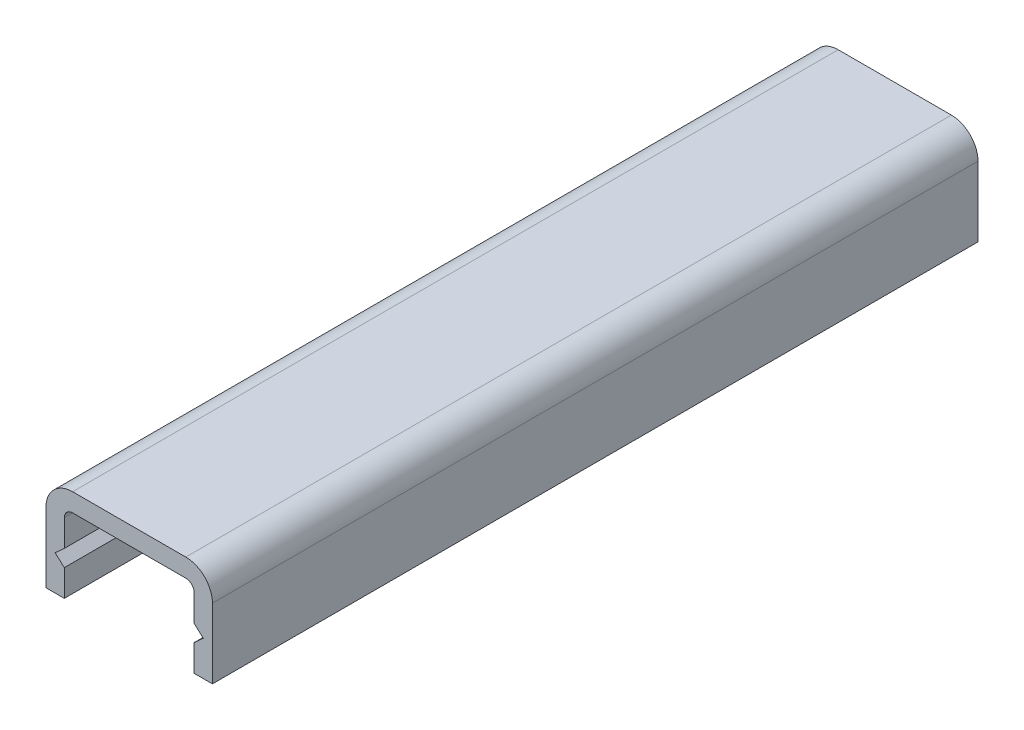
ISO-10303-21;
HEADER;
FILE_DESCRIPTION(('STEP AP214'),'2;1');
FILE_NAME('part.step','',(''),(''),'','','');
FILE_SCHEMA(('AUTOMOTIVE_DESIGN { 1 0 10303 214 1 1 1 1 }'));
ENDSEC;
DATA;
#1=APPLICATION_CONTEXT('core data for automotive mechanical design processes');
#2=APPLICATION_PROTOCOL_DEFINITION('international standard','automotive_design',2000,#1);
#3=PRODUCT_CONTEXT('',#1,'mechanical');
#4=PRODUCT('Part','Part','',(#3));
#5=PRODUCT_RELATED_PRODUCT_CATEGORY('part','',(#4));
#6=PRODUCT_DEFINITION_FORMATION('','',#4);
#7=PRODUCT_DEFINITION_CONTEXT('part definition',#1,'design');
#8=PRODUCT_DEFINITION('design','',#6,#7);
#9=PRODUCT_DEFINITION_SHAPE('','',#8);
#10=(LENGTH_UNIT() NAMED_UNIT(*) SI_UNIT(.MILLI.,.METRE.));
#11=(NAMED_UNIT(*) PLANE_ANGLE_UNIT() SI_UNIT($,.RADIAN.));
#12=(NAMED_UNIT(*) SI_UNIT($,.STERADIAN.) SOLID_ANGLE_UNIT());
#13=UNCERTAINTY_MEASURE_WITH_UNIT(LENGTH_MEASURE(1.E-05),#10,'distance_accuracy_value','');
#14=(GEOMETRIC_REPRESENTATION_CONTEXT(3) GLOBAL_UNCERTAINTY_ASSIGNED_CONTEXT((#13)) GLOBAL_UNIT_ASSIGNED_CONTEXT((#10,
#11,#12)) REPRESENTATION_CONTEXT('',''));
#15=CARTESIAN_POINT('',(0.,0.,0.));
#16=DIRECTION('',(0.,0.,1.));
#17=DIRECTION('',(1.,0.,0.));
#18=AXIS2_PLACEMENT_3D('',#15,#16,#17);
#19=CARTESIAN_POINT('',(0.,0.,46.));
#20=DIRECTION('',(0.,1.,0.));
#21=DIRECTION('',(0.,0.,1.));
#22=AXIS2_PLACEMENT_3D('',#19,#20,#21);
#23=PLANE('',#22);
#24=DIRECTION('',(1.,0.,0.));
#25=VECTOR('',#24,1.);
#26=CARTESIAN_POINT('',(0.,0.,0.));
#27=LINE('',#26,#25);
#28=CARTESIAN_POINT('',(0.,0.,0.));
#29=VERTEX_POINT('',#28);
#30=CARTESIAN_POINT('',(1.1,0.,0.));
#31=VERTEX_POINT('',#30);
#32=EDGE_CURVE('E186',#29,#31,#27,.T.);
#33=ORIENTED_EDGE('',*,*,#32,.T.);
#34=DIRECTION('',(0.,0.,-1.));
#35=VECTOR('',#34,1.);
#36=CARTESIAN_POINT('',(1.1,0.,46.));
#37=LINE('',#36,#35);
#38=CARTESIAN_POINT('',(1.1,0.,46.));
#39=VERTEX_POINT('',#38);
#40=EDGE_CURVE('E11',#39,#31,#37,.T.);
#41=ORIENTED_EDGE('',*,*,#40,.F.);
#42=DIRECTION('',(1.,0.,0.));
#43=VECTOR('',#42,1.);
#44=CARTESIAN_POINT('',(0.,0.,46.));
#45=LINE('',#44,#43);
#46=CARTESIAN_POINT('',(0.,0.,46.));
#47=VERTEX_POINT('',#46);
#48=EDGE_CURVE('E220',#47,#39,#45,.T.);
#49=ORIENTED_EDGE('',*,*,#48,.F.);
#50=DIRECTION('',(0.,0.,-1.));
#51=VECTOR('',#50,1.);
#52=CARTESIAN_POINT('',(0.,0.,46.));
#53=LINE('',#52,#51);
#54=EDGE_CURVE('E182',#47,#29,#53,.T.);
#55=ORIENTED_EDGE('',*,*,#54,.T.);
#56=EDGE_LOOP('',(#33,#41,#49,#55));
#57=FACE_BOUND('',#56,.T.);
#58=ADVANCED_FACE('F30',(#57),#23,.F.);
#59=CARTESIAN_POINT('',(1.1,1.6,46.));
#60=DIRECTION('',(-1.,0.,0.));
#61=DIRECTION('',(0.,0.,1.));
#62=AXIS2_PLACEMENT_3D('',#59,#60,#61);
#63=PLANE('',#62);
#64=DIRECTION('',(0.,1.,0.));
#65=VECTOR('',#64,1.);
#66=CARTESIAN_POINT('',(1.1,1.6,0.));
#67=LINE('',#66,#65);
#68=CARTESIAN_POINT('',(1.1,1.6,0.));
#69=VERTEX_POINT('',#68);
#70=EDGE_CURVE('E189',#31,#69,#67,.T.);
#71=ORIENTED_EDGE('',*,*,#70,.T.);
#72=DIRECTION('',(0.,0.,-1.));
#73=VECTOR('',#72,1.);
#74=CARTESIAN_POINT('',(1.1,1.6,46.));
#75=LINE('',#74,#73);
#76=CARTESIAN_POINT('',(1.1,1.6,46.));
#77=VERTEX_POINT('',#76);
#78=EDGE_CURVE('E38',#77,#69,#75,.T.);
#79=ORIENTED_EDGE('',*,*,#78,.F.);
#80=DIRECTION('',(0.,1.,0.));
#81=VECTOR('',#80,1.);
#82=CARTESIAN_POINT('',(1.1,1.6,46.));
#83=LINE('',#82,#81);
#84=EDGE_CURVE('E119',#39,#77,#83,.T.);
#85=ORIENTED_EDGE('',*,*,#84,.F.);
#86=ORIENTED_EDGE('',*,*,#40,.T.);
#87=EDGE_LOOP('',(#71,#79,#85,#86));
#88=FACE_BOUND('',#87,.T.);
#89=ADVANCED_FACE('F328',(#88),#63,.F.);
#90=CARTESIAN_POINT('',(1.1,1.6,46.));
#91=DIRECTION('',(-0.672672793996314,-0.739940073395942,0.));
#92=DIRECTION('',(0.739940073395943,-0.672672793996314,0.));
#93=AXIS2_PLACEMENT_3D('',#90,#91,#92);
#94=PLANE('',#93);
#95=DIRECTION('',(-0.739940073395943,0.672672793996314,0.));
#96=VECTOR('',#95,1.);
#97=CARTESIAN_POINT('',(1.1,1.6,0.));
#98=LINE('',#97,#96);
#99=CARTESIAN_POINT('',(0.55,2.1,0.));
#100=VERTEX_POINT('',#99);
#101=EDGE_CURVE('E191',#69,#100,#98,.T.);
#102=ORIENTED_EDGE('',*,*,#101,.T.);
#103=DIRECTION('',(0.,0.,-1.));
#104=VECTOR('',#103,1.);
#105=CARTESIAN_POINT('',(0.55,2.1,46.));
#106=LINE('',#105,#104);
#107=CARTESIAN_POINT('',(0.55,2.1,46.));
#108=VERTEX_POINT('',#107);
#109=EDGE_CURVE('E257',#108,#100,#106,.T.);
#110=ORIENTED_EDGE('',*,*,#109,.F.);
#111=DIRECTION('',(-0.739940073395943,0.672672793996314,0.));
#112=VECTOR('',#111,1.);
#113=CARTESIAN_POINT('',(1.1,1.6,46.));
#114=LINE('',#113,#112);
#115=EDGE_CURVE('E265',#77,#108,#114,.T.);
#116=ORIENTED_EDGE('',*,*,#115,.F.);
#117=ORIENTED_EDGE('',*,*,#78,.T.);
#118=EDGE_LOOP('',(#102,#110,#116,#117));
#119=FACE_BOUND('',#118,.T.);
#120=ADVANCED_FACE('F263',(#119),#94,.F.);
#121=CARTESIAN_POINT('',(1.1,2.6,46.));
#122=DIRECTION('',(-0.672672793996311,0.739940073395945,0.));
#123=DIRECTION('',(-0.739940073395945,-0.672672793996311,0.));
#124=AXIS2_PLACEMENT_3D('',#121,#122,#123);
#125=PLANE('',#124);
#126=DIRECTION('',(0.739940073395945,0.672672793996311,0.));
#127=VECTOR('',#126,1.);
#128=CARTESIAN_POINT('',(1.1,2.6,0.));
#129=LINE('',#128,#127);
#130=CARTESIAN_POINT('',(1.1,2.6,0.));
#131=VERTEX_POINT('',#130);
#132=EDGE_CURVE('E193',#100,#131,#129,.T.);
#133=ORIENTED_EDGE('',*,*,#132,.T.);
#134=DIRECTION('',(0.,0.,-1.));
#135=VECTOR('',#134,1.);
#136=CARTESIAN_POINT('',(1.1,2.6,46.));
#137=LINE('',#136,#135);
#138=CARTESIAN_POINT('',(1.1,2.6,46.));
#139=VERTEX_POINT('',#138);
#140=EDGE_CURVE('E254',#139,#131,#137,.T.);
#141=ORIENTED_EDGE('',*,*,#140,.F.);
#142=DIRECTION('',(0.739940073395945,0.672672793996311,0.));
#143=VECTOR('',#142,1.);
#144=CARTESIAN_POINT('',(1.1,2.6,46.));
#145=LINE('',#144,#143);
#146=EDGE_CURVE('E283',#108,#139,#145,.T.);
#147=ORIENTED_EDGE('',*,*,#146,.F.);
#148=ORIENTED_EDGE('',*,*,#109,.T.);
#149=EDGE_LOOP('',(#133,#141,#147,#148));
#150=FACE_BOUND('',#149,.T.);
#151=ADVANCED_FACE('F274',(#150),#125,.F.);
#152=CARTESIAN_POINT('',(1.1,4.2,46.));
#153=DIRECTION('',(-1.,0.,0.));
#154=DIRECTION('',(0.,-1.,0.));
#155=AXIS2_PLACEMENT_3D('',#152,#153,#154);
#156=PLANE('',#155);
#157=DIRECTION('',(0.,1.,0.));
#158=VECTOR('',#157,1.);
#159=CARTESIAN_POINT('',(1.1,4.2,0.));
#160=LINE('',#159,#158);
#161=CARTESIAN_POINT('',(1.1,4.2,0.));
#162=VERTEX_POINT('',#161);
#163=EDGE_CURVE('E195',#131,#162,#160,.T.);
#164=ORIENTED_EDGE('',*,*,#163,.T.);
#165=DIRECTION('',(0.,0.,-1.));
#166=VECTOR('',#165,1.);
#167=CARTESIAN_POINT('',(1.1,4.2,46.));
#168=LINE('',#167,#166);
#169=CARTESIAN_POINT('',(1.1,4.2,46.));
#170=VERTEX_POINT('',#169);
#171=EDGE_CURVE('E251',#170,#162,#168,.T.);
#172=ORIENTED_EDGE('',*,*,#171,.F.);
#173=DIRECTION('',(0.,1.,0.));
#174=VECTOR('',#173,1.);
#175=CARTESIAN_POINT('',(1.1,4.2,46.));
#176=LINE('',#175,#174);
#177=EDGE_CURVE('E280',#139,#170,#176,.T.);
#178=ORIENTED_EDGE('',*,*,#177,.F.);
#179=ORIENTED_EDGE('',*,*,#140,.T.);
#180=EDGE_LOOP('',(#164,#172,#178,#179));
#181=FACE_BOUND('',#180,.T.);
#182=ADVANCED_FACE('F278',(#181),#156,.F.);
#183=CARTESIAN_POINT('',(1.59999999999999,4.2,46.));
#184=DIRECTION('',(0.,0.,-1.));
#185=DIRECTION('',(-1.,0.,0.));
#186=AXIS2_PLACEMENT_3D('',#183,#184,#185);
#187=CYLINDRICAL_SURFACE('',#186,0.499999999999992);
#188=CARTESIAN_POINT('',(1.59999999999999,4.2,0.));
#189=DIRECTION('',(0.,0.,-1.));
#190=DIRECTION('',(1.,0.,0.));
#191=AXIS2_PLACEMENT_3D('',#188,#189,#190);
#192=CIRCLE('',#191,0.499999999999992);
#193=CARTESIAN_POINT('',(1.59999999999999,4.69999999999999,0.));
#194=VERTEX_POINT('',#193);
#195=EDGE_CURVE('E197',#162,#194,#192,.T.);
#196=ORIENTED_EDGE('',*,*,#195,.T.);
#197=DIRECTION('',(0.,0.,-1.));
#198=VECTOR('',#197,1.);
#199=CARTESIAN_POINT('',(1.59999999999999,4.69999999999999,46.));
#200=LINE('',#199,#198);
#201=CARTESIAN_POINT('',(1.59999999999999,4.69999999999999,46.));
#202=VERTEX_POINT('',#201);
#203=EDGE_CURVE('E248',#202,#194,#200,.T.);
#204=ORIENTED_EDGE('',*,*,#203,.F.);
#205=CARTESIAN_POINT('',(1.59999999999999,4.2,46.));
#206=DIRECTION('',(0.,0.,-1.));
#207=DIRECTION('',(1.,0.,0.));
#208=AXIS2_PLACEMENT_3D('',#205,#206,#207);
#209=CIRCLE('',#208,0.499999999999992);
#210=EDGE_CURVE('E282',#170,#202,#209,.T.);
#211=ORIENTED_EDGE('',*,*,#210,.F.);
#212=ORIENTED_EDGE('',*,*,#171,.T.);
#213=EDGE_LOOP('',(#196,#204,#211,#212));
#214=FACE_BOUND('',#213,.T.);
#215=ADVANCED_FACE('F341',(#214),#187,.F.);
#216=CARTESIAN_POINT('',(1.59999999999999,4.69999999999999,46.));
#217=DIRECTION('',(0.,1.,0.));
#218=DIRECTION('',(0.,0.,1.));
#219=AXIS2_PLACEMENT_3D('',#216,#217,#218);
#220=PLANE('',#219);
#221=DIRECTION('',(1.,0.,0.));
#222=VECTOR('',#221,1.);
#223=CARTESIAN_POINT('',(1.59999999999999,4.69999999999999,0.));
#224=LINE('',#223,#222);
#225=CARTESIAN_POINT('',(8.39999999999998,4.69999999999999,0.));
#226=VERTEX_POINT('',#225);
#227=EDGE_CURVE('E199',#194,#226,#224,.T.);
#228=ORIENTED_EDGE('',*,*,#227,.T.);
#229=DIRECTION('',(0.,0.,-1.));
#230=VECTOR('',#229,1.);
#231=CARTESIAN_POINT('',(8.39999999999998,4.69999999999999,46.));
#232=LINE('',#231,#230);
#233=CARTESIAN_POINT('',(8.39999999999998,4.69999999999999,46.));
#234=VERTEX_POINT('',#233);
#235=EDGE_CURVE('E245',#234,#226,#232,.T.);
#236=ORIENTED_EDGE('',*,*,#235,.F.);
#237=DIRECTION('',(1.,0.,0.));
#238=VECTOR('',#237,1.);
#239=CARTESIAN_POINT('',(1.59999999999999,4.69999999999999,46.));
#240=LINE('',#239,#238);
#241=EDGE_CURVE('E285',#202,#234,#240,.T.);
#242=ORIENTED_EDGE('',*,*,#241,.F.);
#243=ORIENTED_EDGE('',*,*,#203,.T.);
#244=EDGE_LOOP('',(#228,#236,#242,#243));
#245=FACE_BOUND('',#244,.T.);
#246=ADVANCED_FACE('F344',(#245),#220,.F.);
#247=CARTESIAN_POINT('',(8.39999999999998,4.2,46.));
#248=DIRECTION('',(0.,0.,-1.));
#249=DIRECTION('',(-1.,0.,0.));
#250=AXIS2_PLACEMENT_3D('',#247,#248,#249);
#251=CYLINDRICAL_SURFACE('',#250,0.499999999999991);
#252=CARTESIAN_POINT('',(8.39999999999998,4.2,0.));
#253=DIRECTION('',(0.,0.,-1.));
#254=DIRECTION('',(1.,0.,0.));
#255=AXIS2_PLACEMENT_3D('',#252,#253,#254);
#256=CIRCLE('',#255,0.499999999999991);
#257=CARTESIAN_POINT('',(8.89999999999997,4.2,0.));
#258=VERTEX_POINT('',#257);
#259=EDGE_CURVE('E201',#226,#258,#256,.T.);
#260=ORIENTED_EDGE('',*,*,#259,.T.);
#261=DIRECTION('',(0.,0.,-1.));
#262=VECTOR('',#261,1.);
#263=CARTESIAN_POINT('',(8.89999999999997,4.2,46.));
#264=LINE('',#263,#262);
#265=CARTESIAN_POINT('',(8.89999999999997,4.2,46.));
#266=VERTEX_POINT('',#265);
#267=EDGE_CURVE('E242',#266,#258,#264,.T.);
#268=ORIENTED_EDGE('',*,*,#267,.F.);
#269=CARTESIAN_POINT('',(8.39999999999998,4.2,46.));
#270=DIRECTION('',(0.,0.,-1.));
#271=DIRECTION('',(1.,0.,0.));
#272=AXIS2_PLACEMENT_3D('',#269,#270,#271);
#273=CIRCLE('',#272,0.499999999999991);
#274=EDGE_CURVE('E291',#234,#266,#273,.T.);
#275=ORIENTED_EDGE('',*,*,#274,.F.);
#276=ORIENTED_EDGE('',*,*,#235,.T.);
#277=EDGE_LOOP('',(#260,#268,#275,#276));
#278=FACE_BOUND('',#277,.T.);
#279=ADVANCED_FACE('F348',(#278),#251,.F.);
#280=CARTESIAN_POINT('',(8.89999999999997,4.2,46.));
#281=DIRECTION('',(1.,0.,0.));
#282=DIRECTION('',(0.,1.,0.));
#283=AXIS2_PLACEMENT_3D('',#280,#281,#282);
#284=PLANE('',#283);
#285=DIRECTION('',(0.,-1.,0.));
#286=VECTOR('',#285,1.);
#287=CARTESIAN_POINT('',(8.89999999999997,4.2,0.));
#288=LINE('',#287,#286);
#289=CARTESIAN_POINT('',(8.89999999999998,2.6,0.));
#290=VERTEX_POINT('',#289);
#291=EDGE_CURVE('E203',#258,#290,#288,.T.);
#292=ORIENTED_EDGE('',*,*,#291,.T.);
#293=DIRECTION('',(0.,0.,-1.));
#294=VECTOR('',#293,1.);
#295=CARTESIAN_POINT('',(8.89999999999998,2.6,46.));
#296=LINE('',#295,#294);
#297=CARTESIAN_POINT('',(8.89999999999998,2.6,46.));
#298=VERTEX_POINT('',#297);
#299=EDGE_CURVE('E239',#298,#290,#296,.T.);
#300=ORIENTED_EDGE('',*,*,#299,.F.);
#301=DIRECTION('',(0.,-1.,0.));
#302=VECTOR('',#301,1.);
#303=CARTESIAN_POINT('',(8.89999999999997,4.2,46.));
#304=LINE('',#303,#302);
#305=EDGE_CURVE('E293',#266,#298,#304,.T.);
#306=ORIENTED_EDGE('',*,*,#305,.F.);
#307=ORIENTED_EDGE('',*,*,#267,.T.);
#308=EDGE_LOOP('',(#292,#300,#306,#307));
#309=FACE_BOUND('',#308,.T.);
#310=ADVANCED_FACE('F352',(#309),#284,.F.);
#311=CARTESIAN_POINT('',(8.89999999999998,2.6,46.));
#312=DIRECTION('',(0.672672793996294,0.739940073395961,0.));
#313=DIRECTION('',(-0.739940073395961,0.672672793996294,0.));
#314=AXIS2_PLACEMENT_3D('',#311,#312,#313);
#315=PLANE('',#314);
#316=DIRECTION('',(0.739940073395961,-0.672672793996294,0.));
#317=VECTOR('',#316,1.);
#318=CARTESIAN_POINT('',(8.89999999999998,2.6,0.));
#319=LINE('',#318,#317);
#320=CARTESIAN_POINT('',(9.45,2.1,0.));
#321=VERTEX_POINT('',#320);
#322=EDGE_CURVE('E205',#290,#321,#319,.T.);
#323=ORIENTED_EDGE('',*,*,#322,.T.);
#324=DIRECTION('',(0.,0.,-1.));
#325=VECTOR('',#324,1.);
#326=CARTESIAN_POINT('',(9.45,2.1,46.));
#327=LINE('',#326,#325);
#328=CARTESIAN_POINT('',(9.45,2.1,46.));
#329=VERTEX_POINT('',#328);
#330=EDGE_CURVE('E236',#329,#321,#327,.T.);
#331=ORIENTED_EDGE('',*,*,#330,.F.);
#332=DIRECTION('',(0.739940073395961,-0.672672793996294,0.));
#333=VECTOR('',#332,1.);
#334=CARTESIAN_POINT('',(8.89999999999998,2.6,46.));
#335=LINE('',#334,#333);
#336=EDGE_CURVE('E295',#298,#329,#335,.T.);
#337=ORIENTED_EDGE('',*,*,#336,.F.);
#338=ORIENTED_EDGE('',*,*,#299,.T.);
#339=EDGE_LOOP('',(#323,#331,#337,#338));
#340=FACE_BOUND('',#339,.T.);
#341=ADVANCED_FACE('F356',(#340),#315,.F.);
#342=CARTESIAN_POINT('',(8.89999999999998,1.6,46.));
#343=DIRECTION('',(0.672672793996296,-0.739940073395959,0.));
#344=DIRECTION('',(0.739940073395959,0.672672793996296,0.));
#345=AXIS2_PLACEMENT_3D('',#342,#343,#344);
#346=PLANE('',#345);
#347=DIRECTION('',(-0.739940073395959,-0.672672793996296,0.));
#348=VECTOR('',#347,1.);
#349=CARTESIAN_POINT('',(8.89999999999998,1.6,0.));
#350=LINE('',#349,#348);
#351=CARTESIAN_POINT('',(8.89999999999998,1.6,0.));
#352=VERTEX_POINT('',#351);
#353=EDGE_CURVE('E207',#321,#352,#350,.T.);
#354=ORIENTED_EDGE('',*,*,#353,.T.);
#355=DIRECTION('',(0.,0.,-1.));
#356=VECTOR('',#355,1.);
#357=CARTESIAN_POINT('',(8.89999999999998,1.6,46.));
#358=LINE('',#357,#356);
#359=CARTESIAN_POINT('',(8.89999999999998,1.6,46.));
#360=VERTEX_POINT('',#359);
#361=EDGE_CURVE('E233',#360,#352,#358,.T.);
#362=ORIENTED_EDGE('',*,*,#361,.F.);
#363=DIRECTION('',(-0.739940073395959,-0.672672793996296,0.));
#364=VECTOR('',#363,1.);
#365=CARTESIAN_POINT('',(8.89999999999998,1.6,46.));
#366=LINE('',#365,#364);
#367=EDGE_CURVE('E297',#329,#360,#366,.T.);
#368=ORIENTED_EDGE('',*,*,#367,.F.);
#369=ORIENTED_EDGE('',*,*,#330,.T.);
#370=EDGE_LOOP('',(#354,#362,#368,#369));
#371=FACE_BOUND('',#370,.T.);
#372=ADVANCED_FACE('F360',(#371),#346,.F.);
#373=CARTESIAN_POINT('',(8.89999999999998,1.6,46.));
#374=DIRECTION('',(1.,0.,0.));
#375=DIRECTION('',(0.,0.,-1.));
#376=AXIS2_PLACEMENT_3D('',#373,#374,#375);
#377=PLANE('',#376);
#378=DIRECTION('',(0.,-1.,0.));
#379=VECTOR('',#378,1.);
#380=CARTESIAN_POINT('',(8.89999999999998,1.6,0.));
#381=LINE('',#380,#379);
#382=CARTESIAN_POINT('',(8.89999999999998,0.,0.));
#383=VERTEX_POINT('',#382);
#384=EDGE_CURVE('E209',#352,#383,#381,.T.);
#385=ORIENTED_EDGE('',*,*,#384,.T.);
#386=DIRECTION('',(0.,0.,-1.));
#387=VECTOR('',#386,1.);
#388=CARTESIAN_POINT('',(8.89999999999998,0.,46.));
#389=LINE('',#388,#387);
#390=CARTESIAN_POINT('',(8.89999999999998,0.,46.));
#391=VERTEX_POINT('',#390);
#392=EDGE_CURVE('E230',#391,#383,#389,.T.);
#393=ORIENTED_EDGE('',*,*,#392,.F.);
#394=DIRECTION('',(0.,-1.,0.));
#395=VECTOR('',#394,1.);
#396=CARTESIAN_POINT('',(8.89999999999998,1.6,46.));
#397=LINE('',#396,#395);
#398=EDGE_CURVE('E299',#360,#391,#397,.T.);
#399=ORIENTED_EDGE('',*,*,#398,.F.);
#400=ORIENTED_EDGE('',*,*,#361,.T.);
#401=EDGE_LOOP('',(#385,#393,#399,#400));
#402=FACE_BOUND('',#401,.T.);
#403=ADVANCED_FACE('F364',(#402),#377,.F.);
#404=CARTESIAN_POINT('',(9.99999999999998,0.,46.));
#405=DIRECTION('',(0.,1.,0.));
#406=DIRECTION('',(0.,0.,1.));
#407=AXIS2_PLACEMENT_3D('',#404,#405,#406);
#408=PLANE('',#407);
#409=DIRECTION('',(1.,0.,0.));
#410=VECTOR('',#409,1.);
#411=CARTESIAN_POINT('',(9.99999999999998,0.,0.));
#412=LINE('',#411,#410);
#413=CARTESIAN_POINT('',(9.99999999999998,0.,0.));
#414=VERTEX_POINT('',#413);
#415=EDGE_CURVE('E211',#383,#414,#412,.T.);
#416=ORIENTED_EDGE('',*,*,#415,.T.);
#417=DIRECTION('',(0.,0.,-1.));
#418=VECTOR('',#417,1.);
#419=CARTESIAN_POINT('',(9.99999999999998,0.,46.));
#420=LINE('',#419,#418);
#421=CARTESIAN_POINT('',(9.99999999999998,0.,46.));
#422=VERTEX_POINT('',#421);
#423=EDGE_CURVE('E227',#422,#414,#420,.T.);
#424=ORIENTED_EDGE('',*,*,#423,.F.);
#425=DIRECTION('',(1.,0.,0.));
#426=VECTOR('',#425,1.);
#427=CARTESIAN_POINT('',(9.99999999999998,0.,46.));
#428=LINE('',#427,#426);
#429=EDGE_CURVE('E301',#391,#422,#428,.T.);
#430=ORIENTED_EDGE('',*,*,#429,.F.);
#431=ORIENTED_EDGE('',*,*,#392,.T.);
#432=EDGE_LOOP('',(#416,#424,#430,#431));
#433=FACE_BOUND('',#432,.T.);
#434=ADVANCED_FACE('F368',(#433),#408,.F.);
#435=CARTESIAN_POINT('',(9.99999999999998,4.19999999999999,46.));
#436=DIRECTION('',(-1.,0.,0.));
#437=DIRECTION('',(0.,0.,1.));
#438=AXIS2_PLACEMENT_3D('',#435,#436,#437);
#439=PLANE('',#438);
#440=DIRECTION('',(0.,1.,0.));
#441=VECTOR('',#440,1.);
#442=CARTESIAN_POINT('',(9.99999999999998,4.19999999999999,0.));
#443=LINE('',#442,#441);
#444=CARTESIAN_POINT('',(9.99999999999998,4.19999999999999,0.));
#445=VERTEX_POINT('',#444);
#446=EDGE_CURVE('E213',#414,#445,#443,.T.);
#447=ORIENTED_EDGE('',*,*,#446,.T.);
#448=DIRECTION('',(0.,0.,-1.));
#449=VECTOR('',#448,1.);
#450=CARTESIAN_POINT('',(9.99999999999998,4.19999999999999,46.));
#451=LINE('',#450,#449);
#452=CARTESIAN_POINT('',(9.99999999999998,4.19999999999999,46.));
#453=VERTEX_POINT('',#452);
#454=EDGE_CURVE('E224',#453,#445,#451,.T.);
#455=ORIENTED_EDGE('',*,*,#454,.F.);
#456=DIRECTION('',(0.,1.,0.));
#457=VECTOR('',#456,1.);
#458=CARTESIAN_POINT('',(9.99999999999998,4.19999999999999,46.));
#459=LINE('',#458,#457);
#460=EDGE_CURVE('E303',#422,#453,#459,.T.);
#461=ORIENTED_EDGE('',*,*,#460,.F.);
#462=ORIENTED_EDGE('',*,*,#423,.T.);
#463=EDGE_LOOP('',(#447,#455,#461,#462));
#464=FACE_BOUND('',#463,.T.);
#465=ADVANCED_FACE('F309',(#464),#439,.F.);
#466=CARTESIAN_POINT('',(8.39999999999998,4.19999999999999,46.));
#467=DIRECTION('',(0.,0.,-1.));
#468=DIRECTION('',(-1.,0.,0.));
#469=AXIS2_PLACEMENT_3D('',#466,#467,#468);
#470=CYLINDRICAL_SURFACE('',#469,1.6);
#471=CARTESIAN_POINT('',(8.39999999999998,4.19999999999999,0.));
#472=DIRECTION('',(0.,0.,1.));
#473=DIRECTION('',(-1.,0.,0.));
#474=AXIS2_PLACEMENT_3D('',#471,#472,#473);
#475=CIRCLE('',#474,1.6);
#476=CARTESIAN_POINT('',(8.39999999999998,5.79999999999999,0.));
#477=VERTEX_POINT('',#476);
#478=EDGE_CURVE('E215',#445,#477,#475,.T.);
#479=ORIENTED_EDGE('',*,*,#478,.T.);
#480=DIRECTION('',(0.,0.,-1.));
#481=VECTOR('',#480,1.);
#482=CARTESIAN_POINT('',(8.39999999999998,5.79999999999999,46.));
#483=LINE('',#482,#481);
#484=CARTESIAN_POINT('',(8.39999999999998,5.79999999999999,46.));
#485=VERTEX_POINT('',#484);
#486=EDGE_CURVE('E177',#485,#477,#483,.T.);
#487=ORIENTED_EDGE('',*,*,#486,.F.);
#488=CARTESIAN_POINT('',(8.39999999999998,4.19999999999999,46.));
#489=DIRECTION('',(0.,0.,1.));
#490=DIRECTION('',(-1.,0.,0.));
#491=AXIS2_PLACEMENT_3D('',#488,#489,#490);
#492=CIRCLE('',#491,1.6);
#493=EDGE_CURVE('E168',#453,#485,#492,.T.);
#494=ORIENTED_EDGE('',*,*,#493,.F.);
#495=ORIENTED_EDGE('',*,*,#454,.T.);
#496=EDGE_LOOP('',(#479,#487,#494,#495));
#497=FACE_BOUND('',#496,.T.);
#498=ADVANCED_FACE('F313',(#497),#470,.T.);
#499=CARTESIAN_POINT('',(1.6,5.79999999999999,46.));
#500=DIRECTION('',(0.,-1.,0.));
#501=DIRECTION('',(0.,0.,-1.));
#502=AXIS2_PLACEMENT_3D('',#499,#500,#501);
#503=PLANE('',#502);
#504=DIRECTION('',(-1.,0.,0.));
#505=VECTOR('',#504,1.);
#506=CARTESIAN_POINT('',(1.6,5.79999999999999,0.));
#507=LINE('',#506,#505);
#508=CARTESIAN_POINT('',(1.6,5.79999999999999,0.));
#509=VERTEX_POINT('',#508);
#510=EDGE_CURVE('E176',#477,#509,#507,.T.);
#511=ORIENTED_EDGE('',*,*,#510,.T.);
#512=DIRECTION('',(0.,0.,-1.));
#513=VECTOR('',#512,1.);
#514=CARTESIAN_POINT('',(1.6,5.79999999999999,46.));
#515=LINE('',#514,#513);
#516=CARTESIAN_POINT('',(1.6,5.79999999999999,46.));
#517=VERTEX_POINT('',#516);
#518=EDGE_CURVE('E173',#517,#509,#515,.T.);
#519=ORIENTED_EDGE('',*,*,#518,.F.);
#520=DIRECTION('',(-1.,0.,0.));
#521=VECTOR('',#520,1.);
#522=CARTESIAN_POINT('',(1.6,5.79999999999999,46.));
#523=LINE('',#522,#521);
#524=EDGE_CURVE('E162',#485,#517,#523,.T.);
#525=ORIENTED_EDGE('',*,*,#524,.F.);
#526=ORIENTED_EDGE('',*,*,#486,.T.);
#527=EDGE_LOOP('',(#511,#519,#525,#526));
#528=FACE_BOUND('',#527,.T.);
#529=ADVANCED_FACE('F174',(#528),#503,.F.);
#530=CARTESIAN_POINT('',(1.6,4.19999999999999,46.));
#531=DIRECTION('',(0.,0.,-1.));
#532=DIRECTION('',(-1.,0.,0.));
#533=AXIS2_PLACEMENT_3D('',#530,#531,#532);
#534=CYLINDRICAL_SURFACE('',#533,1.6);
#535=CARTESIAN_POINT('',(1.6,4.19999999999999,0.));
#536=DIRECTION('',(0.,0.,1.));
#537=DIRECTION('',(-1.,0.,0.));
#538=AXIS2_PLACEMENT_3D('',#535,#536,#537);
#539=CIRCLE('',#538,1.6);
#540=CARTESIAN_POINT('',(0.,4.19999999999999,0.));
#541=VERTEX_POINT('',#540);
#542=EDGE_CURVE('E105',#509,#541,#539,.T.);
#543=ORIENTED_EDGE('',*,*,#542,.T.);
#544=DIRECTION('',(0.,0.,-1.));
#545=VECTOR('',#544,1.);
#546=CARTESIAN_POINT('',(0.,4.19999999999999,46.));
#547=LINE('',#546,#545);
#548=CARTESIAN_POINT('',(0.,4.19999999999999,46.));
#549=VERTEX_POINT('',#548);
#550=EDGE_CURVE('E178',#549,#541,#547,.T.);
#551=ORIENTED_EDGE('',*,*,#550,.F.);
#552=CARTESIAN_POINT('',(1.6,4.19999999999999,46.));
#553=DIRECTION('',(0.,0.,1.));
#554=DIRECTION('',(-1.,0.,0.));
#555=AXIS2_PLACEMENT_3D('',#552,#553,#554);
#556=CIRCLE('',#555,1.6);
#557=EDGE_CURVE('E166',#517,#549,#556,.T.);
#558=ORIENTED_EDGE('',*,*,#557,.F.);
#559=ORIENTED_EDGE('',*,*,#518,.T.);
#560=EDGE_LOOP('',(#543,#551,#558,#559));
#561=FACE_BOUND('',#560,.T.);
#562=ADVANCED_FACE('F180',(#561),#534,.T.);
#563=CARTESIAN_POINT('',(0.,4.19999999999999,46.));
#564=DIRECTION('',(1.,0.,0.));
#565=DIRECTION('',(0.,1.,0.));
#566=AXIS2_PLACEMENT_3D('',#563,#564,#565);
#567=PLANE('',#566);
#568=DIRECTION('',(0.,-1.,0.));
#569=VECTOR('',#568,1.);
#570=CARTESIAN_POINT('',(0.,4.19999999999999,0.));
#571=LINE('',#570,#569);
#572=EDGE_CURVE('E111',#541,#29,#571,.T.);
#573=ORIENTED_EDGE('',*,*,#572,.T.);
#574=ORIENTED_EDGE('',*,*,#54,.F.);
#575=DIRECTION('',(0.,-1.,0.));
#576=VECTOR('',#575,1.);
#577=CARTESIAN_POINT('',(0.,4.19999999999999,46.));
#578=LINE('',#577,#576);
#579=EDGE_CURVE('E46',#549,#47,#578,.T.);
#580=ORIENTED_EDGE('',*,*,#579,.F.);
#581=ORIENTED_EDGE('',*,*,#550,.T.);
#582=EDGE_LOOP('',(#573,#574,#580,#581));
#583=FACE_BOUND('',#582,.T.);
#584=ADVANCED_FACE('F317',(#583),#567,.F.);
#585=CARTESIAN_POINT('',(1.59999999999999,4.2,46.));
#586=DIRECTION('',(0.,0.,1.));
#587=DIRECTION('',(1.,0.,0.));
#588=AXIS2_PLACEMENT_3D('',#585,#586,#587);
#589=PLANE('',#588);
#590=ORIENTED_EDGE('',*,*,#48,.T.);
#591=ORIENTED_EDGE('',*,*,#84,.T.);
#592=ORIENTED_EDGE('',*,*,#115,.T.);
#593=ORIENTED_EDGE('',*,*,#146,.T.);
#594=ORIENTED_EDGE('',*,*,#177,.T.);
#595=ORIENTED_EDGE('',*,*,#210,.T.);
#596=ORIENTED_EDGE('',*,*,#241,.T.);
#597=ORIENTED_EDGE('',*,*,#274,.T.);
#598=ORIENTED_EDGE('',*,*,#305,.T.);
#599=ORIENTED_EDGE('',*,*,#336,.T.);
#600=ORIENTED_EDGE('',*,*,#367,.T.);
#601=ORIENTED_EDGE('',*,*,#398,.T.);
#602=ORIENTED_EDGE('',*,*,#429,.T.);
#603=ORIENTED_EDGE('',*,*,#460,.T.);
#604=ORIENTED_EDGE('',*,*,#493,.T.);
#605=ORIENTED_EDGE('',*,*,#524,.T.);
#606=ORIENTED_EDGE('',*,*,#557,.T.);
#607=ORIENTED_EDGE('',*,*,#579,.T.);
#608=EDGE_LOOP('',(#590,#591,#592,#593,#594,#595,#596,#597,#598,#599,#600,#601,#602,#603,#604,
#605,#606,#607));
#609=FACE_BOUND('',#608,.T.);
#610=ADVANCED_FACE('F164',(#609),#589,.T.);
#611=CARTESIAN_POINT('',(1.59999999999999,4.2,0.));
#612=DIRECTION('',(0.,0.,1.));
#613=DIRECTION('',(1.,0.,0.));
#614=AXIS2_PLACEMENT_3D('',#611,#612,#613);
#615=PLANE('',#614);
#616=ORIENTED_EDGE('',*,*,#32,.F.);
#617=ORIENTED_EDGE('',*,*,#572,.F.);
#618=ORIENTED_EDGE('',*,*,#542,.F.);
#619=ORIENTED_EDGE('',*,*,#510,.F.);
#620=ORIENTED_EDGE('',*,*,#478,.F.);
#621=ORIENTED_EDGE('',*,*,#446,.F.);
#622=ORIENTED_EDGE('',*,*,#415,.F.);
#623=ORIENTED_EDGE('',*,*,#384,.F.);
#624=ORIENTED_EDGE('',*,*,#353,.F.);
#625=ORIENTED_EDGE('',*,*,#322,.F.);
#626=ORIENTED_EDGE('',*,*,#291,.F.);
#627=ORIENTED_EDGE('',*,*,#259,.F.);
#628=ORIENTED_EDGE('',*,*,#227,.F.);
#629=ORIENTED_EDGE('',*,*,#195,.F.);
#630=ORIENTED_EDGE('',*,*,#163,.F.);
#631=ORIENTED_EDGE('',*,*,#132,.F.);
#632=ORIENTED_EDGE('',*,*,#101,.F.);
#633=ORIENTED_EDGE('',*,*,#70,.F.);
#634=EDGE_LOOP('',(#616,#617,#618,#619,#620,#621,#622,#623,#624,#625,#626,#627,#628,#629,#630,
#631,#632,#633));
#635=FACE_BOUND('',#634,.T.);
#636=ADVANCED_FACE('F269',(#635),#615,.F.);
#637=CLOSED_SHELL('',(#58,#89,#120,#151,#182,#215,#246,#279,#310,#341,#372,#403,#434,#465,#498,
#529,#562,#584,#610,#636));
#638=MANIFOLD_SOLID_BREP('B2',#637);
#639=ADVANCED_BREP_SHAPE_REPRESENTATION('',(#18,#638),#14);
#640=SHAPE_DEFINITION_REPRESENTATION(#9,#639);
ENDSEC;
END-ISO-10303-21;
